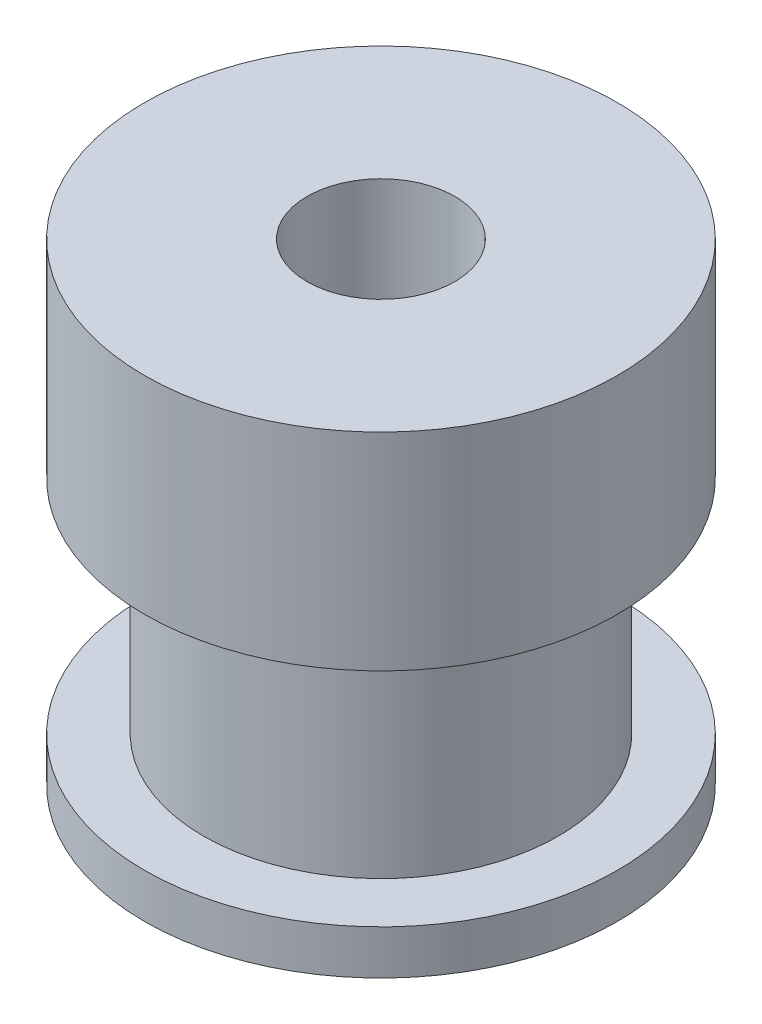
ISO-10303-21;
HEADER;
FILE_DESCRIPTION(('STEP AP214'),'2;1');
FILE_NAME('part.step','',(''),(''),'','','');
FILE_SCHEMA(('AUTOMOTIVE_DESIGN { 1 0 10303 214 1 1 1 1 }'));
ENDSEC;
DATA;
#1=APPLICATION_CONTEXT('core data for automotive mechanical design processes');
#2=APPLICATION_PROTOCOL_DEFINITION('international standard','automotive_design',2000,#1);
#3=PRODUCT_CONTEXT('',#1,'mechanical');
#4=PRODUCT('Part','Part','',(#3));
#5=PRODUCT_RELATED_PRODUCT_CATEGORY('part','',(#4));
#6=PRODUCT_DEFINITION_FORMATION('','',#4);
#7=PRODUCT_DEFINITION_CONTEXT('part definition',#1,'design');
#8=PRODUCT_DEFINITION('design','',#6,#7);
#9=PRODUCT_DEFINITION_SHAPE('','',#8);
#10=(LENGTH_UNIT() NAMED_UNIT(*) SI_UNIT(.MILLI.,.METRE.));
#11=(NAMED_UNIT(*) PLANE_ANGLE_UNIT() SI_UNIT($,.RADIAN.));
#12=(NAMED_UNIT(*) SI_UNIT($,.STERADIAN.) SOLID_ANGLE_UNIT());
#13=UNCERTAINTY_MEASURE_WITH_UNIT(LENGTH_MEASURE(1.E-05),#10,'distance_accuracy_value','');
#14=(GEOMETRIC_REPRESENTATION_CONTEXT(3) GLOBAL_UNCERTAINTY_ASSIGNED_CONTEXT((#13)) GLOBAL_UNIT_ASSIGNED_CONTEXT((#10,
#11,#12)) REPRESENTATION_CONTEXT('',''));
#15=CARTESIAN_POINT('',(0.,0.,0.));
#16=DIRECTION('',(0.,0.,1.));
#17=DIRECTION('',(1.,0.,0.));
#18=AXIS2_PLACEMENT_3D('',#15,#16,#17);
#19=CARTESIAN_POINT('',(0.,16.,0.));
#20=DIRECTION('',(0.,-1.,0.));
#21=DIRECTION('',(0.,0.,-1.));
#22=AXIS2_PLACEMENT_3D('',#19,#20,#21);
#23=CYLINDRICAL_SURFACE('',#22,8.);
#24=CARTESIAN_POINT('',(0.,0.,0.));
#25=DIRECTION('',(0.,1.,0.));
#26=DIRECTION('',(0.,0.,1.));
#27=AXIS2_PLACEMENT_3D('',#24,#25,#26);
#28=CIRCLE('',#27,8.);
#29=CARTESIAN_POINT('',(0.,0.,8.));
#30=VERTEX_POINT('',#29);
#31=EDGE_CURVE('E36',#30,#30,#28,.T.);
#32=ORIENTED_EDGE('',*,*,#31,.T.);
#33=EDGE_LOOP('',(#32));
#34=FACE_BOUND('',#33,.T.);
#35=CARTESIAN_POINT('',(0.,1.5,0.));
#36=DIRECTION('',(0.,1.,0.));
#37=DIRECTION('',(0.,0.,1.));
#38=AXIS2_PLACEMENT_3D('',#35,#36,#37);
#39=CIRCLE('',#38,8.);
#40=CARTESIAN_POINT('',(0.,1.5,8.));
#41=VERTEX_POINT('',#40);
#42=EDGE_CURVE('E48',#41,#41,#39,.T.);
#43=ORIENTED_EDGE('',*,*,#42,.F.);
#44=EDGE_LOOP('',(#43));
#45=FACE_BOUND('',#44,.T.);
#46=ADVANCED_FACE('F32',(#34,#45),#23,.T.);
#47=CARTESIAN_POINT('',(0.,16.,0.));
#48=DIRECTION('',(0.,1.,0.));
#49=DIRECTION('',(0.,0.,1.));
#50=AXIS2_PLACEMENT_3D('',#47,#48,#49);
#51=PLANE('',#50);
#52=CARTESIAN_POINT('',(0.,16.,0.));
#53=DIRECTION('',(0.,1.,0.));
#54=DIRECTION('',(0.,0.,1.));
#55=AXIS2_PLACEMENT_3D('',#52,#53,#54);
#56=CIRCLE('',#55,8.);
#57=CARTESIAN_POINT('',(0.,16.,8.));
#58=VERTEX_POINT('',#57);
#59=EDGE_CURVE('E10',#58,#58,#56,.T.);
#60=ORIENTED_EDGE('',*,*,#59,.T.);
#61=EDGE_LOOP('',(#60));
#62=FACE_BOUND('',#61,.T.);
#63=CARTESIAN_POINT('',(0.,16.,0.));
#64=DIRECTION('',(0.,1.,0.));
#65=DIRECTION('',(0.,0.,1.));
#66=AXIS2_PLACEMENT_3D('',#63,#64,#65);
#67=CIRCLE('',#66,2.5);
#68=CARTESIAN_POINT('',(0.,16.,2.5));
#69=VERTEX_POINT('',#68);
#70=EDGE_CURVE('E43',#69,#69,#67,.T.);
#71=ORIENTED_EDGE('',*,*,#70,.F.);
#72=EDGE_LOOP('',(#71));
#73=FACE_BOUND('',#72,.T.);
#74=ADVANCED_FACE('F75',(#62,#73),#51,.T.);
#75=CARTESIAN_POINT('',(0.,0.,0.));
#76=DIRECTION('',(0.,1.,0.));
#77=DIRECTION('',(0.,0.,1.));
#78=AXIS2_PLACEMENT_3D('',#75,#76,#77);
#79=PLANE('',#78);
#80=ORIENTED_EDGE('',*,*,#31,.F.);
#81=EDGE_LOOP('',(#80));
#82=FACE_BOUND('',#81,.T.);
#83=CARTESIAN_POINT('',(0.,0.,0.));
#84=DIRECTION('',(0.,1.,0.));
#85=DIRECTION('',(0.,0.,1.));
#86=AXIS2_PLACEMENT_3D('',#83,#84,#85);
#87=CIRCLE('',#86,2.5);
#88=CARTESIAN_POINT('',(0.,0.,2.5));
#89=VERTEX_POINT('',#88);
#90=EDGE_CURVE('E45',#89,#89,#87,.T.);
#91=ORIENTED_EDGE('',*,*,#90,.T.);
#92=EDGE_LOOP('',(#91));
#93=FACE_BOUND('',#92,.T.);
#94=ADVANCED_FACE('F80',(#82,#93),#79,.F.);
#95=CARTESIAN_POINT('',(0.,9.,0.));
#96=DIRECTION('',(0.,1.,0.));
#97=DIRECTION('',(0.,0.,1.));
#98=AXIS2_PLACEMENT_3D('',#95,#96,#97);
#99=CIRCLE('',#98,8.);
#100=CARTESIAN_POINT('',(0.,9.,8.));
#101=VERTEX_POINT('',#100);
#102=EDGE_CURVE('E51',#101,#101,#99,.T.);
#103=ORIENTED_EDGE('',*,*,#102,.T.);
#104=EDGE_LOOP('',(#103));
#105=FACE_BOUND('',#104,.T.);
#106=ORIENTED_EDGE('',*,*,#59,.F.);
#107=EDGE_LOOP('',(#106));
#108=FACE_BOUND('',#107,.T.);
#109=ADVANCED_FACE('F34',(#105,#108),#23,.T.);
#110=CARTESIAN_POINT('',(0.,16.,0.));
#111=DIRECTION('',(0.,-1.,0.));
#112=DIRECTION('',(0.,0.,-1.));
#113=AXIS2_PLACEMENT_3D('',#110,#111,#112);
#114=CYLINDRICAL_SURFACE('',#113,2.5);
#115=ORIENTED_EDGE('',*,*,#70,.T.);
#116=EDGE_LOOP('',(#115));
#117=FACE_BOUND('',#116,.T.);
#118=ORIENTED_EDGE('',*,*,#90,.F.);
#119=EDGE_LOOP('',(#118));
#120=FACE_BOUND('',#119,.T.);
#121=ADVANCED_FACE('F70',(#117,#120),#114,.F.);
#122=CARTESIAN_POINT('',(0.,1.5,0.));
#123=DIRECTION('',(0.,1.,0.));
#124=DIRECTION('',(0.,0.,1.));
#125=AXIS2_PLACEMENT_3D('',#122,#123,#124);
#126=PLANE('',#125);
#127=CARTESIAN_POINT('',(0.,1.5,0.));
#128=DIRECTION('',(0.,1.,0.));
#129=DIRECTION('',(0.,0.,1.));
#130=AXIS2_PLACEMENT_3D('',#127,#128,#129);
#131=CIRCLE('',#130,6.);
#132=CARTESIAN_POINT('',(0.,1.5,6.));
#133=VERTEX_POINT('',#132);
#134=EDGE_CURVE('E54',#133,#133,#131,.T.);
#135=ORIENTED_EDGE('',*,*,#134,.F.);
#136=EDGE_LOOP('',(#135));
#137=FACE_BOUND('',#136,.T.);
#138=ORIENTED_EDGE('',*,*,#42,.T.);
#139=EDGE_LOOP('',(#138));
#140=FACE_BOUND('',#139,.T.);
#141=ADVANCED_FACE('F66',(#137,#140),#126,.T.);
#142=CARTESIAN_POINT('',(0.,9.,0.));
#143=DIRECTION('',(0.,1.,0.));
#144=DIRECTION('',(0.,0.,1.));
#145=AXIS2_PLACEMENT_3D('',#142,#143,#144);
#146=PLANE('',#145);
#147=CARTESIAN_POINT('',(0.,9.,0.));
#148=DIRECTION('',(0.,1.,0.));
#149=DIRECTION('',(0.,0.,1.));
#150=AXIS2_PLACEMENT_3D('',#147,#148,#149);
#151=CIRCLE('',#150,6.);
#152=CARTESIAN_POINT('',(0.,9.,6.));
#153=VERTEX_POINT('',#152);
#154=EDGE_CURVE('E57',#153,#153,#151,.T.);
#155=ORIENTED_EDGE('',*,*,#154,.T.);
#156=EDGE_LOOP('',(#155));
#157=FACE_BOUND('',#156,.T.);
#158=ORIENTED_EDGE('',*,*,#102,.F.);
#159=EDGE_LOOP('',(#158));
#160=FACE_BOUND('',#159,.T.);
#161=ADVANCED_FACE('F69',(#157,#160),#146,.F.);
#162=CARTESIAN_POINT('',(0.,1.5,0.));
#163=DIRECTION('',(0.,1.,0.));
#164=DIRECTION('',(0.,0.,1.));
#165=AXIS2_PLACEMENT_3D('',#162,#163,#164);
#166=CYLINDRICAL_SURFACE('',#165,6.);
#167=ORIENTED_EDGE('',*,*,#134,.T.);
#168=EDGE_LOOP('',(#167));
#169=FACE_BOUND('',#168,.T.);
#170=ORIENTED_EDGE('',*,*,#154,.F.);
#171=EDGE_LOOP('',(#170));
#172=FACE_BOUND('',#171,.T.);
#173=ADVANCED_FACE('F63',(#169,#172),#166,.T.);
#174=CLOSED_SHELL('',(#46,#74,#94,#109,#121,#141,#161,#173));
#175=MANIFOLD_SOLID_BREP('B2',#174);
#176=ADVANCED_BREP_SHAPE_REPRESENTATION('',(#18,#175),#14);
#177=SHAPE_DEFINITION_REPRESENTATION(#9,#176);
ENDSEC;
END-ISO-10303-21;
